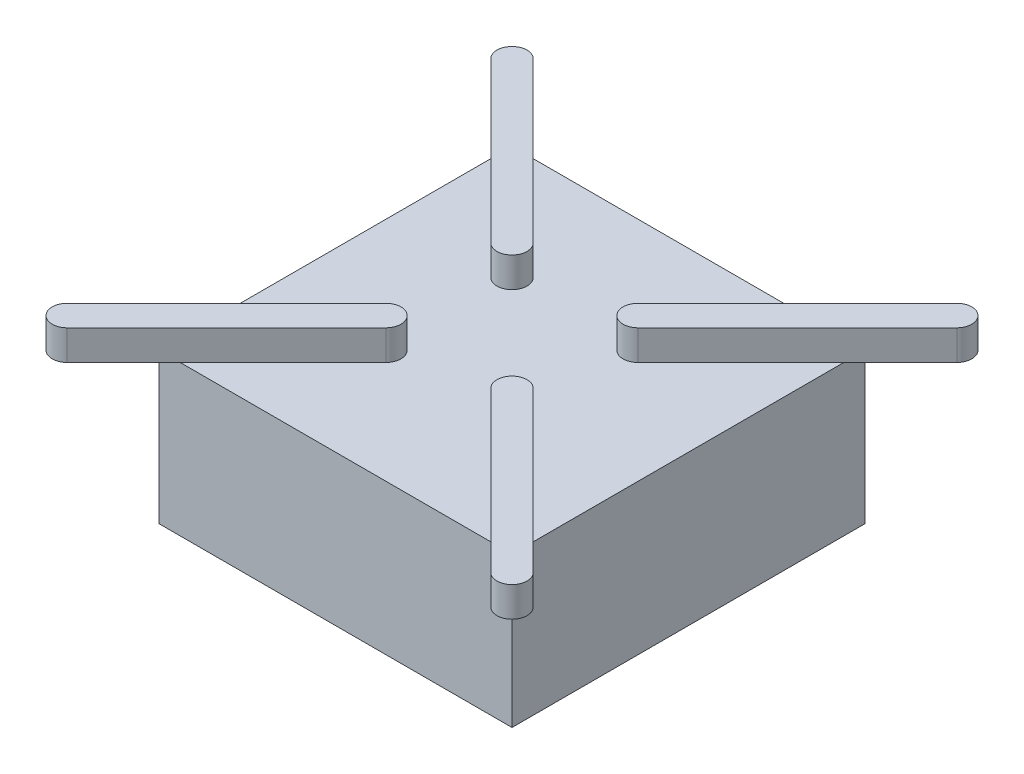
ISO-10303-21;
HEADER;
FILE_DESCRIPTION(('STEP AP214'),'2;1');
FILE_NAME('part.step','',(''),(''),'','','');
FILE_SCHEMA(('AUTOMOTIVE_DESIGN { 1 0 10303 214 1 1 1 1 }'));
ENDSEC;
DATA;
#1=APPLICATION_CONTEXT('core data for automotive mechanical design processes');
#2=APPLICATION_PROTOCOL_DEFINITION('international standard','automotive_design',2000,#1);
#3=PRODUCT_CONTEXT('',#1,'mechanical');
#4=PRODUCT('Part','Part','',(#3));
#5=PRODUCT_RELATED_PRODUCT_CATEGORY('part','',(#4));
#6=PRODUCT_DEFINITION_FORMATION('','',#4);
#7=PRODUCT_DEFINITION_CONTEXT('part definition',#1,'design');
#8=PRODUCT_DEFINITION('design','',#6,#7);
#9=PRODUCT_DEFINITION_SHAPE('','',#8);
#10=(LENGTH_UNIT() NAMED_UNIT(*) SI_UNIT(.MILLI.,.METRE.));
#11=(NAMED_UNIT(*) PLANE_ANGLE_UNIT() SI_UNIT($,.RADIAN.));
#12=(NAMED_UNIT(*) SI_UNIT($,.STERADIAN.) SOLID_ANGLE_UNIT());
#13=UNCERTAINTY_MEASURE_WITH_UNIT(LENGTH_MEASURE(1.E-05),#10,'distance_accuracy_value','');
#14=(GEOMETRIC_REPRESENTATION_CONTEXT(3) GLOBAL_UNCERTAINTY_ASSIGNED_CONTEXT((#13)) GLOBAL_UNIT_ASSIGNED_CONTEXT((#10,
#11,#12)) REPRESENTATION_CONTEXT('',''));
#15=CARTESIAN_POINT('',(0.,0.,0.));
#16=DIRECTION('',(0.,0.,1.));
#17=DIRECTION('',(1.,0.,0.));
#18=AXIS2_PLACEMENT_3D('',#15,#16,#17);
#19=CARTESIAN_POINT('',(0.,0.,0.));
#20=DIRECTION('',(0.,1.,0.));
#21=DIRECTION('',(0.,0.,1.));
#22=AXIS2_PLACEMENT_3D('',#19,#20,#21);
#23=PLANE('',#22);
#24=DIRECTION('',(0.,0.,1.));
#25=VECTOR('',#24,1.);
#26=CARTESIAN_POINT('',(-23.5,0.,-23.5));
#27=LINE('',#26,#25);
#28=CARTESIAN_POINT('',(-23.5,0.,-23.5));
#29=VERTEX_POINT('',#28);
#30=CARTESIAN_POINT('',(-23.5,0.,23.5));
#31=VERTEX_POINT('',#30);
#32=EDGE_CURVE('E402',#29,#31,#27,.T.);
#33=ORIENTED_EDGE('',*,*,#32,.F.);
#34=DIRECTION('',(-1.,0.,0.));
#35=VECTOR('',#34,1.);
#36=CARTESIAN_POINT('',(-23.5,0.,-23.5));
#37=LINE('',#36,#35);
#38=CARTESIAN_POINT('',(23.5,0.,-23.5));
#39=VERTEX_POINT('',#38);
#40=EDGE_CURVE('E429',#39,#29,#37,.T.);
#41=ORIENTED_EDGE('',*,*,#40,.F.);
#42=DIRECTION('',(0.,0.,-1.));
#43=VECTOR('',#42,1.);
#44=CARTESIAN_POINT('',(23.5,0.,-23.5));
#45=LINE('',#44,#43);
#46=CARTESIAN_POINT('',(23.5,0.,23.5));
#47=VERTEX_POINT('',#46);
#48=EDGE_CURVE('E427',#47,#39,#45,.T.);
#49=ORIENTED_EDGE('',*,*,#48,.F.);
#50=DIRECTION('',(1.,0.,0.));
#51=VECTOR('',#50,1.);
#52=CARTESIAN_POINT('',(-23.5,0.,23.5));
#53=LINE('',#52,#51);
#54=EDGE_CURVE('E425',#31,#47,#53,.T.);
#55=ORIENTED_EDGE('',*,*,#54,.F.);
#56=EDGE_LOOP('',(#33,#41,#49,#55));
#57=FACE_BOUND('',#56,.T.);
#58=CARTESIAN_POINT('',(19.,0.,-19.));
#59=DIRECTION('',(0.,1.,0.));
#60=DIRECTION('',(0.,0.,1.));
#61=AXIS2_PLACEMENT_3D('',#58,#59,#60);
#62=CIRCLE('',#61,1.);
#63=CARTESIAN_POINT('',(19.,0.,-18.));
#64=VERTEX_POINT('',#63);
#65=EDGE_CURVE('E442',#64,#64,#62,.F.);
#66=ORIENTED_EDGE('',*,*,#65,.F.);
#67=EDGE_LOOP('',(#66));
#68=FACE_BOUND('',#67,.T.);
#69=CARTESIAN_POINT('',(-19.,0.,-19.));
#70=DIRECTION('',(0.,1.,0.));
#71=DIRECTION('',(0.,0.,1.));
#72=AXIS2_PLACEMENT_3D('',#69,#70,#71);
#73=CIRCLE('',#72,1.);
#74=CARTESIAN_POINT('',(-19.,0.,-18.));
#75=VERTEX_POINT('',#74);
#76=EDGE_CURVE('E445',#75,#75,#73,.F.);
#77=ORIENTED_EDGE('',*,*,#76,.F.);
#78=EDGE_LOOP('',(#77));
#79=FACE_BOUND('',#78,.T.);
#80=CARTESIAN_POINT('',(-19.,0.,19.));
#81=DIRECTION('',(0.,1.,0.));
#82=DIRECTION('',(0.,0.,1.));
#83=AXIS2_PLACEMENT_3D('',#80,#81,#82);
#84=CIRCLE('',#83,1.);
#85=CARTESIAN_POINT('',(-19.,0.,20.));
#86=VERTEX_POINT('',#85);
#87=EDGE_CURVE('E448',#86,#86,#84,.F.);
#88=ORIENTED_EDGE('',*,*,#87,.F.);
#89=EDGE_LOOP('',(#88));
#90=FACE_BOUND('',#89,.T.);
#91=CARTESIAN_POINT('',(19.,0.,19.));
#92=DIRECTION('',(0.,1.,0.));
#93=DIRECTION('',(0.,0.,1.));
#94=AXIS2_PLACEMENT_3D('',#91,#92,#93);
#95=CIRCLE('',#94,1.);
#96=CARTESIAN_POINT('',(19.,0.,20.));
#97=VERTEX_POINT('',#96);
#98=EDGE_CURVE('E450',#97,#97,#95,.F.);
#99=ORIENTED_EDGE('',*,*,#98,.F.);
#100=EDGE_LOOP('',(#99));
#101=FACE_BOUND('',#100,.T.);
#102=DIRECTION('',(0.,0.,-1.));
#103=VECTOR('',#102,1.);
#104=CARTESIAN_POINT('',(-13.,0.,13.));
#105=LINE('',#104,#103);
#106=CARTESIAN_POINT('',(-13.,0.,13.));
#107=VERTEX_POINT('',#106);
#108=CARTESIAN_POINT('',(-13.,0.,-13.));
#109=VERTEX_POINT('',#108);
#110=EDGE_CURVE('E249',#107,#109,#105,.T.);
#111=ORIENTED_EDGE('',*,*,#110,.F.);
#112=DIRECTION('',(-1.,0.,0.));
#113=VECTOR('',#112,1.);
#114=CARTESIAN_POINT('',(-13.,0.,13.));
#115=LINE('',#114,#113);
#116=CARTESIAN_POINT('',(13.,0.,13.));
#117=VERTEX_POINT('',#116);
#118=EDGE_CURVE('E246',#117,#107,#115,.T.);
#119=ORIENTED_EDGE('',*,*,#118,.F.);
#120=DIRECTION('',(0.,0.,1.));
#121=VECTOR('',#120,1.);
#122=CARTESIAN_POINT('',(13.,0.,13.));
#123=LINE('',#122,#121);
#124=CARTESIAN_POINT('',(13.,0.,-13.));
#125=VERTEX_POINT('',#124);
#126=EDGE_CURVE('E64',#125,#117,#123,.T.);
#127=ORIENTED_EDGE('',*,*,#126,.F.);
#128=DIRECTION('',(1.,0.,0.));
#129=VECTOR('',#128,1.);
#130=CARTESIAN_POINT('',(-13.,0.,-13.));
#131=LINE('',#130,#129);
#132=EDGE_CURVE('E59',#109,#125,#131,.T.);
#133=ORIENTED_EDGE('',*,*,#132,.F.);
#134=EDGE_LOOP('',(#111,#119,#127,#133));
#135=FACE_BOUND('',#134,.T.);
#136=ADVANCED_FACE('F44',(#57,#68,#79,#90,#101,#135),#23,.F.);
#137=CARTESIAN_POINT('',(0.,20.,0.));
#138=DIRECTION('',(0.,1.,0.));
#139=DIRECTION('',(0.,0.,1.));
#140=AXIS2_PLACEMENT_3D('',#137,#138,#139);
#141=PLANE('',#140);
#142=DIRECTION('',(-1.,0.,0.));
#143=VECTOR('',#142,1.);
#144=CARTESIAN_POINT('',(-23.5,20.,-23.5));
#145=LINE('',#144,#143);
#146=CARTESIAN_POINT('',(20.6715728752538,20.,-23.5));
#147=VERTEX_POINT('',#146);
#148=CARTESIAN_POINT('',(-20.6715728752538,20.,-23.5));
#149=VERTEX_POINT('',#148);
#150=EDGE_CURVE('E422',#147,#149,#145,.T.);
#151=ORIENTED_EDGE('',*,*,#150,.T.);
#152=DIRECTION('',(-0.707106781186547,0.,-0.707106781186548));
#153=VECTOR('',#152,1.);
#154=CARTESIAN_POINT('',(-6.97918471982869,20.,-9.80761184457488));
#155=LINE('',#154,#153);
#156=CARTESIAN_POINT('',(-6.97918471982869,20.,-9.80761184457488));
#157=VERTEX_POINT('',#156);
#158=EDGE_CURVE('E270',#157,#149,#155,.T.);
#159=ORIENTED_EDGE('',*,*,#158,.F.);
#160=CARTESIAN_POINT('',(-8.39339828220178,20.,-8.39339828220179));
#161=DIRECTION('',(0.,1.,0.));
#162=DIRECTION('',(0.,0.,1.));
#163=AXIS2_PLACEMENT_3D('',#160,#161,#162);
#164=CIRCLE('',#163,2.);
#165=CARTESIAN_POINT('',(-9.80761184457487,20.,-6.97918471982869));
#166=VERTEX_POINT('',#165);
#167=EDGE_CURVE('E250',#166,#157,#164,.T.);
#168=ORIENTED_EDGE('',*,*,#167,.F.);
#169=DIRECTION('',(0.707106781186547,0.,0.707106781186547));
#170=VECTOR('',#169,1.);
#171=CARTESIAN_POINT('',(-9.80761184457487,20.,-6.97918471982869));
#172=LINE('',#171,#170);
#173=CARTESIAN_POINT('',(-23.5,20.,-20.6715728752538));
#174=VERTEX_POINT('',#173);
#175=EDGE_CURVE('E275',#174,#166,#172,.T.);
#176=ORIENTED_EDGE('',*,*,#175,.F.);
#177=DIRECTION('',(0.,0.,1.));
#178=VECTOR('',#177,1.);
#179=CARTESIAN_POINT('',(-23.5,20.,-23.5));
#180=LINE('',#179,#178);
#181=CARTESIAN_POINT('',(-23.5,20.,20.6715728752538));
#182=VERTEX_POINT('',#181);
#183=EDGE_CURVE('E407',#174,#182,#180,.T.);
#184=ORIENTED_EDGE('',*,*,#183,.T.);
#185=DIRECTION('',(-0.707106781186548,0.,0.707106781186547));
#186=VECTOR('',#185,1.);
#187=CARTESIAN_POINT('',(-9.80761184457488,20.,6.97918471982869));
#188=LINE('',#187,#186);
#189=CARTESIAN_POINT('',(-9.80761184457488,20.,6.97918471982869));
#190=VERTEX_POINT('',#189);
#191=EDGE_CURVE('E304',#190,#182,#188,.T.);
#192=ORIENTED_EDGE('',*,*,#191,.F.);
#193=CARTESIAN_POINT('',(-8.39339828220179,20.,8.39339828220179));
#194=DIRECTION('',(0.,1.,0.));
#195=DIRECTION('',(0.,0.,-1.));
#196=AXIS2_PLACEMENT_3D('',#193,#194,#195);
#197=CIRCLE('',#196,2.);
#198=CARTESIAN_POINT('',(-6.97918471982869,20.,9.80761184457488));
#199=VERTEX_POINT('',#198);
#200=EDGE_CURVE('E289',#199,#190,#197,.T.);
#201=ORIENTED_EDGE('',*,*,#200,.F.);
#202=DIRECTION('',(0.707106781186548,0.,-0.707106781186547));
#203=VECTOR('',#202,1.);
#204=CARTESIAN_POINT('',(-6.97918471982869,20.,9.80761184457488));
#205=LINE('',#204,#203);
#206=CARTESIAN_POINT('',(-20.6715728752538,20.,23.5));
#207=VERTEX_POINT('',#206);
#208=EDGE_CURVE('E309',#207,#199,#205,.T.);
#209=ORIENTED_EDGE('',*,*,#208,.F.);
#210=DIRECTION('',(1.,0.,0.));
#211=VECTOR('',#210,1.);
#212=CARTESIAN_POINT('',(-23.5,20.,23.5));
#213=LINE('',#212,#211);
#214=CARTESIAN_POINT('',(20.6715728752538,20.,23.5));
#215=VERTEX_POINT('',#214);
#216=EDGE_CURVE('E412',#207,#215,#213,.T.);
#217=ORIENTED_EDGE('',*,*,#216,.T.);
#218=DIRECTION('',(0.707106781186548,0.,0.707106781186547));
#219=VECTOR('',#218,1.);
#220=CARTESIAN_POINT('',(6.97918471982869,20.,9.80761184457488));
#221=LINE('',#220,#219);
#222=CARTESIAN_POINT('',(6.97918471982869,20.,9.80761184457488));
#223=VERTEX_POINT('',#222);
#224=EDGE_CURVE('E372',#223,#215,#221,.T.);
#225=ORIENTED_EDGE('',*,*,#224,.F.);
#226=CARTESIAN_POINT('',(8.39339828220179,20.,8.39339828220179));
#227=DIRECTION('',(0.,1.,0.));
#228=DIRECTION('',(0.,0.,1.));
#229=AXIS2_PLACEMENT_3D('',#226,#227,#228);
#230=CIRCLE('',#229,2.);
#231=CARTESIAN_POINT('',(9.80761184457488,20.,6.97918471982869));
#232=VERTEX_POINT('',#231);
#233=EDGE_CURVE('E357',#232,#223,#230,.T.);
#234=ORIENTED_EDGE('',*,*,#233,.F.);
#235=DIRECTION('',(-0.707106781186548,0.,-0.707106781186547));
#236=VECTOR('',#235,1.);
#237=CARTESIAN_POINT('',(9.80761184457488,20.,6.97918471982869));
#238=LINE('',#237,#236);
#239=CARTESIAN_POINT('',(23.5,20.,20.6715728752538));
#240=VERTEX_POINT('',#239);
#241=EDGE_CURVE('E52',#240,#232,#238,.T.);
#242=ORIENTED_EDGE('',*,*,#241,.F.);
#243=DIRECTION('',(0.,0.,-1.));
#244=VECTOR('',#243,1.);
#245=CARTESIAN_POINT('',(23.5,20.,-23.5));
#246=LINE('',#245,#244);
#247=CARTESIAN_POINT('',(23.5,20.,-20.6715728752538));
#248=VERTEX_POINT('',#247);
#249=EDGE_CURVE('E417',#240,#248,#246,.T.);
#250=ORIENTED_EDGE('',*,*,#249,.T.);
#251=DIRECTION('',(0.707106781186547,0.,-0.707106781186547));
#252=VECTOR('',#251,1.);
#253=CARTESIAN_POINT('',(9.80761184457487,20.,-6.97918471982869));
#254=LINE('',#253,#252);
#255=CARTESIAN_POINT('',(9.80761184457487,20.,-6.97918471982869));
#256=VERTEX_POINT('',#255);
#257=EDGE_CURVE('E341',#256,#248,#254,.T.);
#258=ORIENTED_EDGE('',*,*,#257,.F.);
#259=CARTESIAN_POINT('',(8.39339828220178,20.,-8.39339828220179));
#260=DIRECTION('',(0.,1.,0.));
#261=DIRECTION('',(0.,0.,-1.));
#262=AXIS2_PLACEMENT_3D('',#259,#260,#261);
#263=CIRCLE('',#262,2.);
#264=CARTESIAN_POINT('',(6.97918471982869,20.,-9.80761184457488));
#265=VERTEX_POINT('',#264);
#266=EDGE_CURVE('E326',#265,#256,#263,.T.);
#267=ORIENTED_EDGE('',*,*,#266,.F.);
#268=DIRECTION('',(0.707106781186547,0.,-0.707106781186548));
#269=VECTOR('',#268,1.);
#270=CARTESIAN_POINT('',(-1.4142135623731,20.,-1.4142135623731));
#271=LINE('',#270,#269);
#272=EDGE_CURVE('E13',#265,#147,#271,.T.);
#273=ORIENTED_EDGE('',*,*,#272,.T.);
#274=EDGE_LOOP('',(#151,#159,#168,#176,#184,#192,#201,#209,#217,#225,#234,#242,#250,#258,#267,#273));
#275=FACE_BOUND('',#274,.T.);
#276=ADVANCED_FACE('F507',(#275),#141,.T.);
#277=CARTESIAN_POINT('',(-23.5,20.,-23.5));
#278=DIRECTION('',(1.,0.,0.));
#279=DIRECTION('',(0.,0.,-1.));
#280=AXIS2_PLACEMENT_3D('',#277,#278,#279);
#281=PLANE('',#280);
#282=ORIENTED_EDGE('',*,*,#32,.T.);
#283=DIRECTION('',(0.,-1.,0.));
#284=VECTOR('',#283,1.);
#285=CARTESIAN_POINT('',(-23.5,20.,23.5));
#286=LINE('',#285,#284);
#287=CARTESIAN_POINT('',(-23.5,20.,23.5));
#288=VERTEX_POINT('',#287);
#289=EDGE_CURVE('E439',#288,#31,#286,.T.);
#290=ORIENTED_EDGE('',*,*,#289,.F.);
#291=DIRECTION('',(0.,0.,-1.));
#292=VECTOR('',#291,1.);
#293=CARTESIAN_POINT('',(-23.5,20.,-23.5));
#294=LINE('',#293,#292);
#295=EDGE_CURVE('E323',#288,#182,#294,.T.);
#296=ORIENTED_EDGE('',*,*,#295,.T.);
#297=ORIENTED_EDGE('',*,*,#183,.F.);
#298=CARTESIAN_POINT('',(-23.5,20.,-23.5));
#299=VERTEX_POINT('',#298);
#300=EDGE_CURVE('E403',#299,#174,#180,.T.);
#301=ORIENTED_EDGE('',*,*,#300,.F.);
#302=DIRECTION('',(0.,-1.,0.));
#303=VECTOR('',#302,1.);
#304=CARTESIAN_POINT('',(-23.5,20.,-23.5));
#305=LINE('',#304,#303);
#306=EDGE_CURVE('E421',#299,#29,#305,.T.);
#307=ORIENTED_EDGE('',*,*,#306,.T.);
#308=EDGE_LOOP('',(#282,#290,#296,#297,#301,#307));
#309=FACE_BOUND('',#308,.T.);
#310=ADVANCED_FACE('F46',(#309),#281,.F.);
#311=CARTESIAN_POINT('',(-23.5,20.,23.5));
#312=DIRECTION('',(0.,0.,-1.));
#313=DIRECTION('',(-1.,0.,0.));
#314=AXIS2_PLACEMENT_3D('',#311,#312,#313);
#315=PLANE('',#314);
#316=ORIENTED_EDGE('',*,*,#54,.T.);
#317=DIRECTION('',(0.,-1.,0.));
#318=VECTOR('',#317,1.);
#319=CARTESIAN_POINT('',(23.5,20.,23.5));
#320=LINE('',#319,#318);
#321=CARTESIAN_POINT('',(23.5,20.,23.5));
#322=VERTEX_POINT('',#321);
#323=EDGE_CURVE('E436',#322,#47,#320,.T.);
#324=ORIENTED_EDGE('',*,*,#323,.F.);
#325=EDGE_CURVE('E406',#215,#322,#213,.T.);
#326=ORIENTED_EDGE('',*,*,#325,.F.);
#327=ORIENTED_EDGE('',*,*,#216,.F.);
#328=EDGE_CURVE('E408',#288,#207,#213,.T.);
#329=ORIENTED_EDGE('',*,*,#328,.F.);
#330=ORIENTED_EDGE('',*,*,#289,.T.);
#331=EDGE_LOOP('',(#316,#324,#326,#327,#329,#330));
#332=FACE_BOUND('',#331,.T.);
#333=ADVANCED_FACE('F546',(#332),#315,.F.);
#334=CARTESIAN_POINT('',(23.5,20.,-23.5));
#335=DIRECTION('',(-1.,0.,0.));
#336=DIRECTION('',(0.,0.,1.));
#337=AXIS2_PLACEMENT_3D('',#334,#335,#336);
#338=PLANE('',#337);
#339=ORIENTED_EDGE('',*,*,#48,.T.);
#340=DIRECTION('',(0.,-1.,0.));
#341=VECTOR('',#340,1.);
#342=CARTESIAN_POINT('',(23.5,20.,-23.5));
#343=LINE('',#342,#341);
#344=CARTESIAN_POINT('',(23.5,20.,-23.5));
#345=VERTEX_POINT('',#344);
#346=EDGE_CURVE('E433',#345,#39,#343,.T.);
#347=ORIENTED_EDGE('',*,*,#346,.F.);
#348=EDGE_CURVE('E411',#248,#345,#246,.T.);
#349=ORIENTED_EDGE('',*,*,#348,.F.);
#350=ORIENTED_EDGE('',*,*,#249,.F.);
#351=EDGE_CURVE('E413',#322,#240,#246,.T.);
#352=ORIENTED_EDGE('',*,*,#351,.F.);
#353=ORIENTED_EDGE('',*,*,#323,.T.);
#354=EDGE_LOOP('',(#339,#347,#349,#350,#352,#353));
#355=FACE_BOUND('',#354,.T.);
#356=ADVANCED_FACE('F481',(#355),#338,.F.);
#357=CARTESIAN_POINT('',(-23.5,20.,-23.5));
#358=DIRECTION('',(0.,0.,1.));
#359=DIRECTION('',(1.,0.,0.));
#360=AXIS2_PLACEMENT_3D('',#357,#358,#359);
#361=PLANE('',#360);
#362=ORIENTED_EDGE('',*,*,#40,.T.);
#363=ORIENTED_EDGE('',*,*,#306,.F.);
#364=EDGE_CURVE('E416',#149,#299,#145,.T.);
#365=ORIENTED_EDGE('',*,*,#364,.F.);
#366=ORIENTED_EDGE('',*,*,#150,.F.);
#367=EDGE_CURVE('E418',#345,#147,#145,.T.);
#368=ORIENTED_EDGE('',*,*,#367,.F.);
#369=ORIENTED_EDGE('',*,*,#346,.T.);
#370=EDGE_LOOP('',(#362,#363,#365,#366,#368,#369));
#371=FACE_BOUND('',#370,.T.);
#372=ADVANCED_FACE('F494',(#371),#361,.F.);
#373=CARTESIAN_POINT('',(19.,-3.,-19.));
#374=DIRECTION('',(0.,1.,0.));
#375=DIRECTION('',(0.,0.,1.));
#376=AXIS2_PLACEMENT_3D('',#373,#374,#375);
#377=CYLINDRICAL_SURFACE('',#376,1.);
#378=CARTESIAN_POINT('',(19.,-3.,-19.));
#379=DIRECTION('',(0.,-1.,0.));
#380=DIRECTION('',(0.,0.,-1.));
#381=AXIS2_PLACEMENT_3D('',#378,#379,#380);
#382=CIRCLE('',#381,1.);
#383=CARTESIAN_POINT('',(19.,-3.,-20.));
#384=VERTEX_POINT('',#383);
#385=EDGE_CURVE('E399',#384,#384,#382,.T.);
#386=ORIENTED_EDGE('',*,*,#385,.F.);
#387=EDGE_LOOP('',(#386));
#388=FACE_BOUND('',#387,.T.);
#389=ORIENTED_EDGE('',*,*,#65,.T.);
#390=EDGE_LOOP('',(#389));
#391=FACE_BOUND('',#390,.T.);
#392=ADVANCED_FACE('F544',(#388,#391),#377,.T.);
#393=CARTESIAN_POINT('',(19.,-3.,-19.));
#394=DIRECTION('',(0.,-1.,0.));
#395=DIRECTION('',(0.,0.,-1.));
#396=AXIS2_PLACEMENT_3D('',#393,#394,#395);
#397=PLANE('',#396);
#398=ORIENTED_EDGE('',*,*,#385,.T.);
#399=EDGE_LOOP('',(#398));
#400=FACE_BOUND('',#399,.T.);
#401=ADVANCED_FACE('F611',(#400),#397,.T.);
#402=CARTESIAN_POINT('',(-19.,-3.,-19.));
#403=DIRECTION('',(0.,1.,0.));
#404=DIRECTION('',(0.,0.,1.));
#405=AXIS2_PLACEMENT_3D('',#402,#403,#404);
#406=CYLINDRICAL_SURFACE('',#405,1.);
#407=CARTESIAN_POINT('',(-19.,-3.,-19.));
#408=DIRECTION('',(0.,-1.,0.));
#409=DIRECTION('',(0.,0.,1.));
#410=AXIS2_PLACEMENT_3D('',#407,#408,#409);
#411=CIRCLE('',#410,1.);
#412=CARTESIAN_POINT('',(-19.,-3.,-18.));
#413=VERTEX_POINT('',#412);
#414=EDGE_CURVE('E396',#413,#413,#411,.T.);
#415=ORIENTED_EDGE('',*,*,#414,.F.);
#416=EDGE_LOOP('',(#415));
#417=FACE_BOUND('',#416,.T.);
#418=ORIENTED_EDGE('',*,*,#76,.T.);
#419=EDGE_LOOP('',(#418));
#420=FACE_BOUND('',#419,.T.);
#421=ADVANCED_FACE('F607',(#417,#420),#406,.T.);
#422=CARTESIAN_POINT('',(-19.,-3.,-19.));
#423=DIRECTION('',(0.,1.,0.));
#424=DIRECTION('',(0.,0.,1.));
#425=AXIS2_PLACEMENT_3D('',#422,#423,#424);
#426=PLANE('',#425);
#427=ORIENTED_EDGE('',*,*,#414,.T.);
#428=EDGE_LOOP('',(#427));
#429=FACE_BOUND('',#428,.T.);
#430=ADVANCED_FACE('F603',(#429),#426,.F.);
#431=CARTESIAN_POINT('',(-19.,-3.,19.));
#432=DIRECTION('',(0.,1.,0.));
#433=DIRECTION('',(0.,0.,1.));
#434=AXIS2_PLACEMENT_3D('',#431,#432,#433);
#435=CYLINDRICAL_SURFACE('',#434,1.);
#436=CARTESIAN_POINT('',(-19.,-3.,19.));
#437=DIRECTION('',(0.,-1.,0.));
#438=DIRECTION('',(0.,0.,-1.));
#439=AXIS2_PLACEMENT_3D('',#436,#437,#438);
#440=CIRCLE('',#439,1.);
#441=CARTESIAN_POINT('',(-19.,-3.,18.));
#442=VERTEX_POINT('',#441);
#443=EDGE_CURVE('E393',#442,#442,#440,.T.);
#444=ORIENTED_EDGE('',*,*,#443,.F.);
#445=EDGE_LOOP('',(#444));
#446=FACE_BOUND('',#445,.T.);
#447=ORIENTED_EDGE('',*,*,#87,.T.);
#448=EDGE_LOOP('',(#447));
#449=FACE_BOUND('',#448,.T.);
#450=ADVANCED_FACE('F599',(#446,#449),#435,.T.);
#451=CARTESIAN_POINT('',(-19.,-3.,19.));
#452=DIRECTION('',(0.,-1.,0.));
#453=DIRECTION('',(0.,0.,-1.));
#454=AXIS2_PLACEMENT_3D('',#451,#452,#453);
#455=PLANE('',#454);
#456=ORIENTED_EDGE('',*,*,#443,.T.);
#457=EDGE_LOOP('',(#456));
#458=FACE_BOUND('',#457,.T.);
#459=ADVANCED_FACE('F595',(#458),#455,.T.);
#460=CARTESIAN_POINT('',(19.,-3.,19.));
#461=DIRECTION('',(0.,1.,0.));
#462=DIRECTION('',(0.,0.,1.));
#463=AXIS2_PLACEMENT_3D('',#460,#461,#462);
#464=CYLINDRICAL_SURFACE('',#463,1.);
#465=CARTESIAN_POINT('',(19.,-3.,19.));
#466=DIRECTION('',(0.,-1.,0.));
#467=DIRECTION('',(0.,0.,1.));
#468=AXIS2_PLACEMENT_3D('',#465,#466,#467);
#469=CIRCLE('',#468,1.);
#470=CARTESIAN_POINT('',(19.,-3.,20.));
#471=VERTEX_POINT('',#470);
#472=EDGE_CURVE('E390',#471,#471,#469,.T.);
#473=ORIENTED_EDGE('',*,*,#472,.F.);
#474=EDGE_LOOP('',(#473));
#475=FACE_BOUND('',#474,.T.);
#476=ORIENTED_EDGE('',*,*,#98,.T.);
#477=EDGE_LOOP('',(#476));
#478=FACE_BOUND('',#477,.T.);
#479=ADVANCED_FACE('F591',(#475,#478),#464,.T.);
#480=CARTESIAN_POINT('',(19.,-3.,19.));
#481=DIRECTION('',(0.,1.,0.));
#482=DIRECTION('',(0.,0.,1.));
#483=AXIS2_PLACEMENT_3D('',#480,#481,#482);
#484=PLANE('',#483);
#485=ORIENTED_EDGE('',*,*,#472,.T.);
#486=EDGE_LOOP('',(#485));
#487=FACE_BOUND('',#486,.T.);
#488=ADVANCED_FACE('F588',(#487),#484,.F.);
#489=CARTESIAN_POINT('',(8.39339828220179,20.,8.39339828220179));
#490=DIRECTION('',(0.,1.,0.));
#491=DIRECTION('',(0.,0.,1.));
#492=AXIS2_PLACEMENT_3D('',#489,#490,#491);
#493=PLANE('',#492);
#494=CARTESIAN_POINT('',(28.1923881554251,20.,31.0208152801713));
#495=VERTEX_POINT('',#494);
#496=EDGE_CURVE('E371',#215,#495,#221,.T.);
#497=ORIENTED_EDGE('',*,*,#496,.F.);
#498=ORIENTED_EDGE('',*,*,#325,.T.);
#499=ORIENTED_EDGE('',*,*,#351,.T.);
#500=CARTESIAN_POINT('',(31.0208152801713,20.,28.1923881554251));
#501=VERTEX_POINT('',#500);
#502=EDGE_CURVE('E362',#501,#240,#238,.T.);
#503=ORIENTED_EDGE('',*,*,#502,.F.);
#504=CARTESIAN_POINT('',(29.6066017177982,20.,29.6066017177982));
#505=DIRECTION('',(0.,1.,0.));
#506=DIRECTION('',(0.,0.,1.));
#507=AXIS2_PLACEMENT_3D('',#504,#505,#506);
#508=CIRCLE('',#507,2.);
#509=EDGE_CURVE('E375',#495,#501,#508,.T.);
#510=ORIENTED_EDGE('',*,*,#509,.F.);
#511=EDGE_LOOP('',(#497,#498,#499,#503,#510));
#512=FACE_BOUND('',#511,.T.);
#513=ADVANCED_FACE('F476',(#512),#493,.F.);
#514=CARTESIAN_POINT('',(8.39339828220179,24.,8.39339828220179));
#515=DIRECTION('',(0.,-1.,0.));
#516=DIRECTION('',(0.,0.,-1.));
#517=AXIS2_PLACEMENT_3D('',#514,#515,#516);
#518=CYLINDRICAL_SURFACE('',#517,2.);
#519=ORIENTED_EDGE('',*,*,#233,.T.);
#520=DIRECTION('',(0.,-1.,0.));
#521=VECTOR('',#520,1.);
#522=CARTESIAN_POINT('',(6.97918471982869,24.,9.80761184457488));
#523=LINE('',#522,#521);
#524=CARTESIAN_POINT('',(6.97918471982869,24.,9.80761184457488));
#525=VERTEX_POINT('',#524);
#526=EDGE_CURVE('E387',#525,#223,#523,.T.);
#527=ORIENTED_EDGE('',*,*,#526,.F.);
#528=CARTESIAN_POINT('',(8.39339828220179,24.,8.39339828220179));
#529=DIRECTION('',(0.,1.,0.));
#530=DIRECTION('',(0.,0.,1.));
#531=AXIS2_PLACEMENT_3D('',#528,#529,#530);
#532=CIRCLE('',#531,2.);
#533=CARTESIAN_POINT('',(9.80761184457488,24.,6.97918471982869));
#534=VERTEX_POINT('',#533);
#535=EDGE_CURVE('E358',#534,#525,#532,.T.);
#536=ORIENTED_EDGE('',*,*,#535,.F.);
#537=DIRECTION('',(0.,-1.,0.));
#538=VECTOR('',#537,1.);
#539=CARTESIAN_POINT('',(9.80761184457488,24.,6.97918471982869));
#540=LINE('',#539,#538);
#541=EDGE_CURVE('E368',#534,#232,#540,.T.);
#542=ORIENTED_EDGE('',*,*,#541,.T.);
#543=EDGE_LOOP('',(#519,#527,#536,#542));
#544=FACE_BOUND('',#543,.T.);
#545=ADVANCED_FACE('F465',(#544),#518,.T.);
#546=CARTESIAN_POINT('',(6.97918471982869,24.,9.80761184457488));
#547=DIRECTION('',(0.707106781186547,0.,-0.707106781186548));
#548=DIRECTION('',(-0.707106781186548,0.,-0.707106781186547));
#549=AXIS2_PLACEMENT_3D('',#546,#547,#548);
#550=PLANE('',#549);
#551=ORIENTED_EDGE('',*,*,#224,.T.);
#552=ORIENTED_EDGE('',*,*,#496,.T.);
#553=DIRECTION('',(0.,-1.,0.));
#554=VECTOR('',#553,1.);
#555=CARTESIAN_POINT('',(28.1923881554251,24.,31.0208152801713));
#556=LINE('',#555,#554);
#557=CARTESIAN_POINT('',(28.1923881554251,24.,31.0208152801713));
#558=VERTEX_POINT('',#557);
#559=EDGE_CURVE('E384',#558,#495,#556,.T.);
#560=ORIENTED_EDGE('',*,*,#559,.F.);
#561=DIRECTION('',(0.707106781186548,0.,0.707106781186547));
#562=VECTOR('',#561,1.);
#563=CARTESIAN_POINT('',(6.97918471982869,24.,9.80761184457488));
#564=LINE('',#563,#562);
#565=EDGE_CURVE('E361',#525,#558,#564,.T.);
#566=ORIENTED_EDGE('',*,*,#565,.F.);
#567=ORIENTED_EDGE('',*,*,#526,.T.);
#568=EDGE_LOOP('',(#551,#552,#560,#566,#567));
#569=FACE_BOUND('',#568,.T.);
#570=ADVANCED_FACE('F574',(#569),#550,.F.);
#571=CARTESIAN_POINT('',(29.6066017177982,24.,29.6066017177982));
#572=DIRECTION('',(0.,-1.,0.));
#573=DIRECTION('',(0.,0.,-1.));
#574=AXIS2_PLACEMENT_3D('',#571,#572,#573);
#575=CYLINDRICAL_SURFACE('',#574,2.);
#576=ORIENTED_EDGE('',*,*,#509,.T.);
#577=DIRECTION('',(0.,-1.,0.));
#578=VECTOR('',#577,1.);
#579=CARTESIAN_POINT('',(31.0208152801713,24.,28.1923881554251));
#580=LINE('',#579,#578);
#581=CARTESIAN_POINT('',(31.0208152801713,24.,28.1923881554251));
#582=VERTEX_POINT('',#581);
#583=EDGE_CURVE('E381',#582,#501,#580,.T.);
#584=ORIENTED_EDGE('',*,*,#583,.F.);
#585=CARTESIAN_POINT('',(29.6066017177982,24.,29.6066017177982));
#586=DIRECTION('',(0.,1.,0.));
#587=DIRECTION('',(0.,0.,1.));
#588=AXIS2_PLACEMENT_3D('',#585,#586,#587);
#589=CIRCLE('',#588,2.);
#590=EDGE_CURVE('E364',#558,#582,#589,.T.);
#591=ORIENTED_EDGE('',*,*,#590,.F.);
#592=ORIENTED_EDGE('',*,*,#559,.T.);
#593=EDGE_LOOP('',(#576,#584,#591,#592));
#594=FACE_BOUND('',#593,.T.);
#595=ADVANCED_FACE('F575',(#594),#575,.T.);
#596=CARTESIAN_POINT('',(9.80761184457488,24.,6.97918471982869));
#597=DIRECTION('',(-0.707106781186547,0.,0.707106781186548));
#598=DIRECTION('',(0.707106781186548,0.,0.707106781186547));
#599=AXIS2_PLACEMENT_3D('',#596,#597,#598);
#600=PLANE('',#599);
#601=ORIENTED_EDGE('',*,*,#502,.T.);
#602=ORIENTED_EDGE('',*,*,#241,.T.);
#603=ORIENTED_EDGE('',*,*,#541,.F.);
#604=DIRECTION('',(-0.707106781186548,0.,-0.707106781186547));
#605=VECTOR('',#604,1.);
#606=CARTESIAN_POINT('',(9.80761184457488,24.,6.97918471982869));
#607=LINE('',#606,#605);
#608=EDGE_CURVE('E366',#582,#534,#607,.T.);
#609=ORIENTED_EDGE('',*,*,#608,.F.);
#610=ORIENTED_EDGE('',*,*,#583,.T.);
#611=EDGE_LOOP('',(#601,#602,#603,#609,#610));
#612=FACE_BOUND('',#611,.T.);
#613=ADVANCED_FACE('F457',(#612),#600,.F.);
#614=CARTESIAN_POINT('',(8.39339828220179,24.,8.39339828220179));
#615=DIRECTION('',(0.,1.,0.));
#616=DIRECTION('',(0.,0.,1.));
#617=AXIS2_PLACEMENT_3D('',#614,#615,#616);
#618=PLANE('',#617);
#619=ORIENTED_EDGE('',*,*,#535,.T.);
#620=ORIENTED_EDGE('',*,*,#565,.T.);
#621=ORIENTED_EDGE('',*,*,#590,.T.);
#622=ORIENTED_EDGE('',*,*,#608,.T.);
#623=EDGE_LOOP('',(#619,#620,#621,#622));
#624=FACE_BOUND('',#623,.T.);
#625=ADVANCED_FACE('F468',(#624),#618,.T.);
#626=CARTESIAN_POINT('',(8.39339828220178,20.,-8.39339828220179));
#627=DIRECTION('',(0.,-1.,0.));
#628=DIRECTION('',(0.,0.,-1.));
#629=AXIS2_PLACEMENT_3D('',#626,#627,#628);
#630=PLANE('',#629);
#631=ORIENTED_EDGE('',*,*,#348,.T.);
#632=ORIENTED_EDGE('',*,*,#367,.T.);
#633=DIRECTION('',(-0.707106781186547,0.,0.707106781186548));
#634=VECTOR('',#633,1.);
#635=CARTESIAN_POINT('',(6.97918471982869,20.,-9.80761184457488));
#636=LINE('',#635,#634);
#637=CARTESIAN_POINT('',(28.1923881554251,20.,-31.0208152801713));
#638=VERTEX_POINT('',#637);
#639=EDGE_CURVE('E331',#638,#147,#636,.T.);
#640=ORIENTED_EDGE('',*,*,#639,.F.);
#641=CARTESIAN_POINT('',(29.6066017177982,20.,-29.6066017177982));
#642=DIRECTION('',(0.,1.,0.));
#643=DIRECTION('',(0.,0.,-1.));
#644=AXIS2_PLACEMENT_3D('',#641,#642,#643);
#645=CIRCLE('',#644,2.);
#646=CARTESIAN_POINT('',(31.0208152801713,20.,-28.1923881554251));
#647=VERTEX_POINT('',#646);
#648=EDGE_CURVE('E344',#647,#638,#645,.T.);
#649=ORIENTED_EDGE('',*,*,#648,.F.);
#650=EDGE_CURVE('E340',#248,#647,#254,.T.);
#651=ORIENTED_EDGE('',*,*,#650,.F.);
#652=EDGE_LOOP('',(#631,#632,#640,#649,#651));
#653=FACE_BOUND('',#652,.T.);
#654=ADVANCED_FACE('F487',(#653),#630,.T.);
#655=CARTESIAN_POINT('',(8.39339828220178,24.,-8.39339828220179));
#656=DIRECTION('',(0.,-1.,0.));
#657=DIRECTION('',(0.,0.,-1.));
#658=AXIS2_PLACEMENT_3D('',#655,#656,#657);
#659=CYLINDRICAL_SURFACE('',#658,2.);
#660=ORIENTED_EDGE('',*,*,#266,.T.);
#661=DIRECTION('',(0.,-1.,0.));
#662=VECTOR('',#661,1.);
#663=CARTESIAN_POINT('',(9.80761184457487,24.,-6.97918471982869));
#664=LINE('',#663,#662);
#665=CARTESIAN_POINT('',(9.80761184457487,24.,-6.97918471982869));
#666=VERTEX_POINT('',#665);
#667=EDGE_CURVE('E355',#666,#256,#664,.T.);
#668=ORIENTED_EDGE('',*,*,#667,.F.);
#669=CARTESIAN_POINT('',(8.39339828220178,24.,-8.39339828220179));
#670=DIRECTION('',(0.,1.,0.));
#671=DIRECTION('',(0.,0.,-1.));
#672=AXIS2_PLACEMENT_3D('',#669,#670,#671);
#673=CIRCLE('',#672,2.);
#674=CARTESIAN_POINT('',(6.97918471982869,24.,-9.80761184457488));
#675=VERTEX_POINT('',#674);
#676=EDGE_CURVE('E327',#675,#666,#673,.T.);
#677=ORIENTED_EDGE('',*,*,#676,.F.);
#678=DIRECTION('',(0.,-1.,0.));
#679=VECTOR('',#678,1.);
#680=CARTESIAN_POINT('',(6.97918471982869,24.,-9.80761184457488));
#681=LINE('',#680,#679);
#682=EDGE_CURVE('E337',#675,#265,#681,.T.);
#683=ORIENTED_EDGE('',*,*,#682,.T.);
#684=EDGE_LOOP('',(#660,#668,#677,#683));
#685=FACE_BOUND('',#684,.T.);
#686=ADVANCED_FACE('F687',(#685),#659,.T.);
#687=CARTESIAN_POINT('',(9.80761184457487,24.,-6.97918471982869));
#688=DIRECTION('',(-0.707106781186548,0.,-0.707106781186548));
#689=DIRECTION('',(-0.707106781186547,0.,0.707106781186548));
#690=AXIS2_PLACEMENT_3D('',#687,#688,#689);
#691=PLANE('',#690);
#692=ORIENTED_EDGE('',*,*,#257,.T.);
#693=ORIENTED_EDGE('',*,*,#650,.T.);
#694=DIRECTION('',(0.,-1.,0.));
#695=VECTOR('',#694,1.);
#696=CARTESIAN_POINT('',(31.0208152801713,24.,-28.1923881554251));
#697=LINE('',#696,#695);
#698=CARTESIAN_POINT('',(31.0208152801713,24.,-28.1923881554251));
#699=VERTEX_POINT('',#698);
#700=EDGE_CURVE('E352',#699,#647,#697,.T.);
#701=ORIENTED_EDGE('',*,*,#700,.F.);
#702=DIRECTION('',(0.707106781186547,0.,-0.707106781186547));
#703=VECTOR('',#702,1.);
#704=CARTESIAN_POINT('',(9.80761184457487,24.,-6.97918471982869));
#705=LINE('',#704,#703);
#706=EDGE_CURVE('E330',#666,#699,#705,.T.);
#707=ORIENTED_EDGE('',*,*,#706,.F.);
#708=ORIENTED_EDGE('',*,*,#667,.T.);
#709=EDGE_LOOP('',(#692,#693,#701,#707,#708));
#710=FACE_BOUND('',#709,.T.);
#711=ADVANCED_FACE('F694',(#710),#691,.F.);
#712=CARTESIAN_POINT('',(29.6066017177982,24.,-29.6066017177982));
#713=DIRECTION('',(0.,-1.,0.));
#714=DIRECTION('',(0.,0.,-1.));
#715=AXIS2_PLACEMENT_3D('',#712,#713,#714);
#716=CYLINDRICAL_SURFACE('',#715,2.);
#717=ORIENTED_EDGE('',*,*,#648,.T.);
#718=DIRECTION('',(0.,-1.,0.));
#719=VECTOR('',#718,1.);
#720=CARTESIAN_POINT('',(28.1923881554251,24.,-31.0208152801713));
#721=LINE('',#720,#719);
#722=CARTESIAN_POINT('',(28.1923881554251,24.,-31.0208152801713));
#723=VERTEX_POINT('',#722);
#724=EDGE_CURVE('E349',#723,#638,#721,.T.);
#725=ORIENTED_EDGE('',*,*,#724,.F.);
#726=CARTESIAN_POINT('',(29.6066017177982,24.,-29.6066017177982));
#727=DIRECTION('',(0.,1.,0.));
#728=DIRECTION('',(0.,0.,-1.));
#729=AXIS2_PLACEMENT_3D('',#726,#727,#728);
#730=CIRCLE('',#729,2.);
#731=EDGE_CURVE('E333',#699,#723,#730,.T.);
#732=ORIENTED_EDGE('',*,*,#731,.F.);
#733=ORIENTED_EDGE('',*,*,#700,.T.);
#734=EDGE_LOOP('',(#717,#725,#732,#733));
#735=FACE_BOUND('',#734,.T.);
#736=ADVANCED_FACE('F690',(#735),#716,.T.);
#737=CARTESIAN_POINT('',(6.97918471982869,24.,-9.80761184457488));
#738=DIRECTION('',(0.707106781186548,0.,0.707106781186547));
#739=DIRECTION('',(0.707106781186547,0.,-0.707106781186548));
#740=AXIS2_PLACEMENT_3D('',#737,#738,#739);
#741=PLANE('',#740);
#742=ORIENTED_EDGE('',*,*,#639,.T.);
#743=ORIENTED_EDGE('',*,*,#272,.F.);
#744=ORIENTED_EDGE('',*,*,#682,.F.);
#745=DIRECTION('',(-0.707106781186547,0.,0.707106781186548));
#746=VECTOR('',#745,1.);
#747=CARTESIAN_POINT('',(6.97918471982869,24.,-9.80761184457488));
#748=LINE('',#747,#746);
#749=EDGE_CURVE('E335',#723,#675,#748,.T.);
#750=ORIENTED_EDGE('',*,*,#749,.F.);
#751=ORIENTED_EDGE('',*,*,#724,.T.);
#752=EDGE_LOOP('',(#742,#743,#744,#750,#751));
#753=FACE_BOUND('',#752,.T.);
#754=ADVANCED_FACE('F683',(#753),#741,.F.);
#755=CARTESIAN_POINT('',(8.39339828220178,24.,-8.39339828220179));
#756=DIRECTION('',(0.,-1.,0.));
#757=DIRECTION('',(0.,0.,-1.));
#758=AXIS2_PLACEMENT_3D('',#755,#756,#757);
#759=PLANE('',#758);
#760=ORIENTED_EDGE('',*,*,#676,.T.);
#761=ORIENTED_EDGE('',*,*,#706,.T.);
#762=ORIENTED_EDGE('',*,*,#731,.T.);
#763=ORIENTED_EDGE('',*,*,#749,.T.);
#764=EDGE_LOOP('',(#760,#761,#762,#763));
#765=FACE_BOUND('',#764,.T.);
#766=ADVANCED_FACE('F672',(#765),#759,.F.);
#767=CARTESIAN_POINT('',(-8.39339828220179,20.,8.39339828220179));
#768=DIRECTION('',(0.,-1.,0.));
#769=DIRECTION('',(0.,0.,-1.));
#770=AXIS2_PLACEMENT_3D('',#767,#768,#769);
#771=PLANE('',#770);
#772=ORIENTED_EDGE('',*,*,#295,.F.);
#773=ORIENTED_EDGE('',*,*,#328,.T.);
#774=CARTESIAN_POINT('',(-28.1923881554251,20.,31.0208152801713));
#775=VERTEX_POINT('',#774);
#776=EDGE_CURVE('E294',#775,#207,#205,.T.);
#777=ORIENTED_EDGE('',*,*,#776,.F.);
#778=CARTESIAN_POINT('',(-29.6066017177982,20.,29.6066017177982));
#779=DIRECTION('',(0.,1.,0.));
#780=DIRECTION('',(0.,0.,-1.));
#781=AXIS2_PLACEMENT_3D('',#778,#779,#780);
#782=CIRCLE('',#781,2.);
#783=CARTESIAN_POINT('',(-31.0208152801713,20.,28.1923881554251));
#784=VERTEX_POINT('',#783);
#785=EDGE_CURVE('E307',#784,#775,#782,.T.);
#786=ORIENTED_EDGE('',*,*,#785,.F.);
#787=EDGE_CURVE('E303',#182,#784,#188,.T.);
#788=ORIENTED_EDGE('',*,*,#787,.F.);
#789=EDGE_LOOP('',(#772,#773,#777,#786,#788));
#790=FACE_BOUND('',#789,.T.);
#791=ADVANCED_FACE('F571',(#790),#771,.T.);
#792=CARTESIAN_POINT('',(-8.39339828220179,24.,8.39339828220179));
#793=DIRECTION('',(0.,-1.,0.));
#794=DIRECTION('',(0.,0.,-1.));
#795=AXIS2_PLACEMENT_3D('',#792,#793,#794);
#796=CYLINDRICAL_SURFACE('',#795,2.);
#797=ORIENTED_EDGE('',*,*,#200,.T.);
#798=DIRECTION('',(0.,-1.,0.));
#799=VECTOR('',#798,1.);
#800=CARTESIAN_POINT('',(-9.80761184457488,24.,6.97918471982869));
#801=LINE('',#800,#799);
#802=CARTESIAN_POINT('',(-9.80761184457488,24.,6.97918471982869));
#803=VERTEX_POINT('',#802);
#804=EDGE_CURVE('E320',#803,#190,#801,.T.);
#805=ORIENTED_EDGE('',*,*,#804,.F.);
#806=CARTESIAN_POINT('',(-8.39339828220179,24.,8.39339828220179));
#807=DIRECTION('',(0.,1.,0.));
#808=DIRECTION('',(0.,0.,-1.));
#809=AXIS2_PLACEMENT_3D('',#806,#807,#808);
#810=CIRCLE('',#809,2.);
#811=CARTESIAN_POINT('',(-6.97918471982869,24.,9.80761184457488));
#812=VERTEX_POINT('',#811);
#813=EDGE_CURVE('E290',#812,#803,#810,.T.);
#814=ORIENTED_EDGE('',*,*,#813,.F.);
#815=DIRECTION('',(0.,-1.,0.));
#816=VECTOR('',#815,1.);
#817=CARTESIAN_POINT('',(-6.97918471982869,24.,9.80761184457488));
#818=LINE('',#817,#816);
#819=EDGE_CURVE('E300',#812,#199,#818,.T.);
#820=ORIENTED_EDGE('',*,*,#819,.T.);
#821=EDGE_LOOP('',(#797,#805,#814,#820));
#822=FACE_BOUND('',#821,.T.);
#823=ADVANCED_FACE('F564',(#822),#796,.T.);
#824=CARTESIAN_POINT('',(-9.80761184457488,24.,6.97918471982869));
#825=DIRECTION('',(0.707106781186547,0.,0.707106781186548));
#826=DIRECTION('',(0.707106781186548,0.,-0.707106781186547));
#827=AXIS2_PLACEMENT_3D('',#824,#825,#826);
#828=PLANE('',#827);
#829=ORIENTED_EDGE('',*,*,#191,.T.);
#830=ORIENTED_EDGE('',*,*,#787,.T.);
#831=DIRECTION('',(0.,-1.,0.));
#832=VECTOR('',#831,1.);
#833=CARTESIAN_POINT('',(-31.0208152801713,24.,28.1923881554251));
#834=LINE('',#833,#832);
#835=CARTESIAN_POINT('',(-31.0208152801713,24.,28.1923881554251));
#836=VERTEX_POINT('',#835);
#837=EDGE_CURVE('E317',#836,#784,#834,.T.);
#838=ORIENTED_EDGE('',*,*,#837,.F.);
#839=DIRECTION('',(-0.707106781186548,0.,0.707106781186547));
#840=VECTOR('',#839,1.);
#841=CARTESIAN_POINT('',(-9.80761184457488,24.,6.97918471982869));
#842=LINE('',#841,#840);
#843=EDGE_CURVE('E293',#803,#836,#842,.T.);
#844=ORIENTED_EDGE('',*,*,#843,.F.);
#845=ORIENTED_EDGE('',*,*,#804,.T.);
#846=EDGE_LOOP('',(#829,#830,#838,#844,#845));
#847=FACE_BOUND('',#846,.T.);
#848=ADVANCED_FACE('F560',(#847),#828,.F.);
#849=CARTESIAN_POINT('',(-29.6066017177982,24.,29.6066017177982));
#850=DIRECTION('',(0.,-1.,0.));
#851=DIRECTION('',(0.,0.,-1.));
#852=AXIS2_PLACEMENT_3D('',#849,#850,#851);
#853=CYLINDRICAL_SURFACE('',#852,2.);
#854=ORIENTED_EDGE('',*,*,#785,.T.);
#855=DIRECTION('',(0.,-1.,0.));
#856=VECTOR('',#855,1.);
#857=CARTESIAN_POINT('',(-28.1923881554251,24.,31.0208152801713));
#858=LINE('',#857,#856);
#859=CARTESIAN_POINT('',(-28.1923881554251,24.,31.0208152801713));
#860=VERTEX_POINT('',#859);
#861=EDGE_CURVE('E314',#860,#775,#858,.T.);
#862=ORIENTED_EDGE('',*,*,#861,.F.);
#863=CARTESIAN_POINT('',(-29.6066017177982,24.,29.6066017177982));
#864=DIRECTION('',(0.,1.,0.));
#865=DIRECTION('',(0.,0.,-1.));
#866=AXIS2_PLACEMENT_3D('',#863,#864,#865);
#867=CIRCLE('',#866,2.);
#868=EDGE_CURVE('E296',#836,#860,#867,.T.);
#869=ORIENTED_EDGE('',*,*,#868,.F.);
#870=ORIENTED_EDGE('',*,*,#837,.T.);
#871=EDGE_LOOP('',(#854,#862,#869,#870));
#872=FACE_BOUND('',#871,.T.);
#873=ADVANCED_FACE('F668',(#872),#853,.T.);
#874=CARTESIAN_POINT('',(-6.97918471982869,24.,9.80761184457488));
#875=DIRECTION('',(-0.707106781186547,0.,-0.707106781186548));
#876=DIRECTION('',(-0.707106781186548,0.,0.707106781186547));
#877=AXIS2_PLACEMENT_3D('',#874,#875,#876);
#878=PLANE('',#877);
#879=ORIENTED_EDGE('',*,*,#776,.T.);
#880=ORIENTED_EDGE('',*,*,#208,.T.);
#881=ORIENTED_EDGE('',*,*,#819,.F.);
#882=DIRECTION('',(0.707106781186548,0.,-0.707106781186547));
#883=VECTOR('',#882,1.);
#884=CARTESIAN_POINT('',(-6.97918471982869,24.,9.80761184457488));
#885=LINE('',#884,#883);
#886=EDGE_CURVE('E298',#860,#812,#885,.T.);
#887=ORIENTED_EDGE('',*,*,#886,.F.);
#888=ORIENTED_EDGE('',*,*,#861,.T.);
#889=EDGE_LOOP('',(#879,#880,#881,#887,#888));
#890=FACE_BOUND('',#889,.T.);
#891=ADVANCED_FACE('F568',(#890),#878,.F.);
#892=CARTESIAN_POINT('',(-8.39339828220179,24.,8.39339828220179));
#893=DIRECTION('',(0.,-1.,0.));
#894=DIRECTION('',(0.,0.,-1.));
#895=AXIS2_PLACEMENT_3D('',#892,#893,#894);
#896=PLANE('',#895);
#897=ORIENTED_EDGE('',*,*,#813,.T.);
#898=ORIENTED_EDGE('',*,*,#843,.T.);
#899=ORIENTED_EDGE('',*,*,#868,.T.);
#900=ORIENTED_EDGE('',*,*,#886,.T.);
#901=EDGE_LOOP('',(#897,#898,#899,#900));
#902=FACE_BOUND('',#901,.T.);
#903=ADVANCED_FACE('F657',(#902),#896,.F.);
#904=CARTESIAN_POINT('',(-8.39339828220178,20.,-8.39339828220179));
#905=DIRECTION('',(0.,1.,0.));
#906=DIRECTION('',(0.,0.,1.));
#907=AXIS2_PLACEMENT_3D('',#904,#905,#906);
#908=PLANE('',#907);
#909=ORIENTED_EDGE('',*,*,#364,.T.);
#910=ORIENTED_EDGE('',*,*,#300,.T.);
#911=CARTESIAN_POINT('',(-31.0208152801713,20.,-28.1923881554251));
#912=VERTEX_POINT('',#911);
#913=EDGE_CURVE('E263',#912,#174,#172,.T.);
#914=ORIENTED_EDGE('',*,*,#913,.F.);
#915=CARTESIAN_POINT('',(-29.6066017177982,20.,-29.6066017177982));
#916=DIRECTION('',(0.,1.,0.));
#917=DIRECTION('',(0.,0.,1.));
#918=AXIS2_PLACEMENT_3D('',#915,#916,#917);
#919=CIRCLE('',#918,2.);
#920=CARTESIAN_POINT('',(-28.1923881554251,20.,-31.0208152801713));
#921=VERTEX_POINT('',#920);
#922=EDGE_CURVE('E273',#921,#912,#919,.T.);
#923=ORIENTED_EDGE('',*,*,#922,.F.);
#924=EDGE_CURVE('E253',#149,#921,#155,.T.);
#925=ORIENTED_EDGE('',*,*,#924,.F.);
#926=EDGE_LOOP('',(#909,#910,#914,#923,#925));
#927=FACE_BOUND('',#926,.T.);
#928=ADVANCED_FACE('F500',(#927),#908,.F.);
#929=CARTESIAN_POINT('',(-8.39339828220178,24.,-8.39339828220179));
#930=DIRECTION('',(0.,-1.,0.));
#931=DIRECTION('',(0.,0.,-1.));
#932=AXIS2_PLACEMENT_3D('',#929,#930,#931);
#933=CYLINDRICAL_SURFACE('',#932,2.);
#934=ORIENTED_EDGE('',*,*,#167,.T.);
#935=DIRECTION('',(0.,-1.,0.));
#936=VECTOR('',#935,1.);
#937=CARTESIAN_POINT('',(-6.97918471982869,24.,-9.80761184457488));
#938=LINE('',#937,#936);
#939=CARTESIAN_POINT('',(-6.97918471982869,24.,-9.80761184457488));
#940=VERTEX_POINT('',#939);
#941=EDGE_CURVE('E286',#940,#157,#938,.T.);
#942=ORIENTED_EDGE('',*,*,#941,.F.);
#943=CARTESIAN_POINT('',(-8.39339828220178,24.,-8.39339828220179));
#944=DIRECTION('',(0.,1.,0.));
#945=DIRECTION('',(0.,0.,1.));
#946=AXIS2_PLACEMENT_3D('',#943,#944,#945);
#947=CIRCLE('',#946,2.);
#948=CARTESIAN_POINT('',(-9.80761184457487,24.,-6.97918471982869));
#949=VERTEX_POINT('',#948);
#950=EDGE_CURVE('E259',#949,#940,#947,.T.);
#951=ORIENTED_EDGE('',*,*,#950,.F.);
#952=DIRECTION('',(0.,-1.,0.));
#953=VECTOR('',#952,1.);
#954=CARTESIAN_POINT('',(-9.80761184457487,24.,-6.97918471982869));
#955=LINE('',#954,#953);
#956=EDGE_CURVE('E268',#949,#166,#955,.T.);
#957=ORIENTED_EDGE('',*,*,#956,.T.);
#958=EDGE_LOOP('',(#934,#942,#951,#957));
#959=FACE_BOUND('',#958,.T.);
#960=ADVANCED_FACE('F516',(#959),#933,.T.);
#961=CARTESIAN_POINT('',(-6.97918471982869,24.,-9.80761184457488));
#962=DIRECTION('',(-0.707106781186548,0.,0.707106781186547));
#963=DIRECTION('',(0.707106781186547,0.,0.707106781186548));
#964=AXIS2_PLACEMENT_3D('',#961,#962,#963);
#965=PLANE('',#964);
#966=ORIENTED_EDGE('',*,*,#158,.T.);
#967=ORIENTED_EDGE('',*,*,#924,.T.);
#968=DIRECTION('',(0.,-1.,0.));
#969=VECTOR('',#968,1.);
#970=CARTESIAN_POINT('',(-28.1923881554251,24.,-31.0208152801713));
#971=LINE('',#970,#969);
#972=CARTESIAN_POINT('',(-28.1923881554251,24.,-31.0208152801713));
#973=VERTEX_POINT('',#972);
#974=EDGE_CURVE('E283',#973,#921,#971,.T.);
#975=ORIENTED_EDGE('',*,*,#974,.F.);
#976=DIRECTION('',(-0.707106781186547,0.,-0.707106781186548));
#977=VECTOR('',#976,1.);
#978=CARTESIAN_POINT('',(-6.97918471982869,24.,-9.80761184457488));
#979=LINE('',#978,#977);
#980=EDGE_CURVE('E262',#940,#973,#979,.T.);
#981=ORIENTED_EDGE('',*,*,#980,.F.);
#982=ORIENTED_EDGE('',*,*,#941,.T.);
#983=EDGE_LOOP('',(#966,#967,#975,#981,#982));
#984=FACE_BOUND('',#983,.T.);
#985=ADVANCED_FACE('F505',(#984),#965,.F.);
#986=CARTESIAN_POINT('',(-29.6066017177982,24.,-29.6066017177982));
#987=DIRECTION('',(0.,-1.,0.));
#988=DIRECTION('',(0.,0.,-1.));
#989=AXIS2_PLACEMENT_3D('',#986,#987,#988);
#990=CYLINDRICAL_SURFACE('',#989,2.);
#991=ORIENTED_EDGE('',*,*,#922,.T.);
#992=DIRECTION('',(0.,-1.,0.));
#993=VECTOR('',#992,1.);
#994=CARTESIAN_POINT('',(-31.0208152801713,24.,-28.1923881554251));
#995=LINE('',#994,#993);
#996=CARTESIAN_POINT('',(-31.0208152801713,24.,-28.1923881554251));
#997=VERTEX_POINT('',#996);
#998=EDGE_CURVE('E280',#997,#912,#995,.T.);
#999=ORIENTED_EDGE('',*,*,#998,.F.);
#1000=CARTESIAN_POINT('',(-29.6066017177982,24.,-29.6066017177982));
#1001=DIRECTION('',(0.,1.,0.));
#1002=DIRECTION('',(0.,0.,1.));
#1003=AXIS2_PLACEMENT_3D('',#1000,#1001,#1002);
#1004=CIRCLE('',#1003,2.);
#1005=EDGE_CURVE('E265',#973,#997,#1004,.T.);
#1006=ORIENTED_EDGE('',*,*,#1005,.F.);
#1007=ORIENTED_EDGE('',*,*,#974,.T.);
#1008=EDGE_LOOP('',(#991,#999,#1006,#1007));
#1009=FACE_BOUND('',#1008,.T.);
#1010=ADVANCED_FACE('F522',(#1009),#990,.T.);
#1011=CARTESIAN_POINT('',(-9.80761184457487,24.,-6.97918471982869));
#1012=DIRECTION('',(0.707106781186548,0.,-0.707106781186548));
#1013=DIRECTION('',(-0.707106781186547,0.,-0.707106781186548));
#1014=AXIS2_PLACEMENT_3D('',#1011,#1012,#1013);
#1015=PLANE('',#1014);
#1016=ORIENTED_EDGE('',*,*,#913,.T.);
#1017=ORIENTED_EDGE('',*,*,#175,.T.);
#1018=ORIENTED_EDGE('',*,*,#956,.F.);
#1019=DIRECTION('',(0.707106781186547,0.,0.707106781186547));
#1020=VECTOR('',#1019,1.);
#1021=CARTESIAN_POINT('',(-9.80761184457487,24.,-6.97918471982869));
#1022=LINE('',#1021,#1020);
#1023=EDGE_CURVE('E267',#997,#949,#1022,.T.);
#1024=ORIENTED_EDGE('',*,*,#1023,.F.);
#1025=ORIENTED_EDGE('',*,*,#998,.T.);
#1026=EDGE_LOOP('',(#1016,#1017,#1018,#1024,#1025));
#1027=FACE_BOUND('',#1026,.T.);
#1028=ADVANCED_FACE('F513',(#1027),#1015,.F.);
#1029=CARTESIAN_POINT('',(-8.39339828220178,24.,-8.39339828220179));
#1030=DIRECTION('',(0.,1.,0.));
#1031=DIRECTION('',(0.,0.,1.));
#1032=AXIS2_PLACEMENT_3D('',#1029,#1030,#1031);
#1033=PLANE('',#1032);
#1034=ORIENTED_EDGE('',*,*,#950,.T.);
#1035=ORIENTED_EDGE('',*,*,#980,.T.);
#1036=ORIENTED_EDGE('',*,*,#1005,.T.);
#1037=ORIENTED_EDGE('',*,*,#1023,.T.);
#1038=EDGE_LOOP('',(#1034,#1035,#1036,#1037));
#1039=FACE_BOUND('',#1038,.T.);
#1040=ADVANCED_FACE('F518',(#1039),#1033,.T.);
#1041=CARTESIAN_POINT('',(-13.,-2.,13.));
#1042=DIRECTION('',(1.,0.,0.));
#1043=DIRECTION('',(0.,0.,-1.));
#1044=AXIS2_PLACEMENT_3D('',#1041,#1042,#1043);
#1045=PLANE('',#1044);
#1046=ORIENTED_EDGE('',*,*,#110,.T.);
#1047=DIRECTION('',(0.,1.,0.));
#1048=VECTOR('',#1047,1.);
#1049=CARTESIAN_POINT('',(-13.,-2.,-13.));
#1050=LINE('',#1049,#1048);
#1051=CARTESIAN_POINT('',(-13.,-2.,-13.));
#1052=VERTEX_POINT('',#1051);
#1053=EDGE_CURVE('E230',#1052,#109,#1050,.T.);
#1054=ORIENTED_EDGE('',*,*,#1053,.F.);
#1055=DIRECTION('',(0.,0.,-1.));
#1056=VECTOR('',#1055,1.);
#1057=CARTESIAN_POINT('',(-13.,-2.,13.));
#1058=LINE('',#1057,#1056);
#1059=CARTESIAN_POINT('',(-13.,-2.,13.));
#1060=VERTEX_POINT('',#1059);
#1061=EDGE_CURVE('E237',#1060,#1052,#1058,.T.);
#1062=ORIENTED_EDGE('',*,*,#1061,.F.);
#1063=DIRECTION('',(0.,1.,0.));
#1064=VECTOR('',#1063,1.);
#1065=CARTESIAN_POINT('',(-13.,-2.,13.));
#1066=LINE('',#1065,#1064);
#1067=EDGE_CURVE('E632',#1060,#107,#1066,.T.);
#1068=ORIENTED_EDGE('',*,*,#1067,.T.);
#1069=EDGE_LOOP('',(#1046,#1054,#1062,#1068));
#1070=FACE_BOUND('',#1069,.T.);
#1071=ADVANCED_FACE('F248',(#1070),#1045,.F.);
#1072=CARTESIAN_POINT('',(-13.,-2.,-13.));
#1073=DIRECTION('',(0.,0.,1.));
#1074=DIRECTION('',(1.,0.,0.));
#1075=AXIS2_PLACEMENT_3D('',#1072,#1073,#1074);
#1076=PLANE('',#1075);
#1077=ORIENTED_EDGE('',*,*,#132,.T.);
#1078=DIRECTION('',(0.,1.,0.));
#1079=VECTOR('',#1078,1.);
#1080=CARTESIAN_POINT('',(13.,-2.,-13.));
#1081=LINE('',#1080,#1079);
#1082=CARTESIAN_POINT('',(13.,-2.,-13.));
#1083=VERTEX_POINT('',#1082);
#1084=EDGE_CURVE('E233',#1083,#125,#1081,.T.);
#1085=ORIENTED_EDGE('',*,*,#1084,.F.);
#1086=DIRECTION('',(1.,0.,0.));
#1087=VECTOR('',#1086,1.);
#1088=CARTESIAN_POINT('',(-13.,-2.,-13.));
#1089=LINE('',#1088,#1087);
#1090=EDGE_CURVE('E226',#1052,#1083,#1089,.T.);
#1091=ORIENTED_EDGE('',*,*,#1090,.F.);
#1092=ORIENTED_EDGE('',*,*,#1053,.T.);
#1093=EDGE_LOOP('',(#1077,#1085,#1091,#1092));
#1094=FACE_BOUND('',#1093,.T.);
#1095=ADVANCED_FACE('F228',(#1094),#1076,.F.);
#1096=CARTESIAN_POINT('',(13.,-2.,13.));
#1097=DIRECTION('',(-1.,0.,0.));
#1098=DIRECTION('',(0.,0.,1.));
#1099=AXIS2_PLACEMENT_3D('',#1096,#1097,#1098);
#1100=PLANE('',#1099);
#1101=ORIENTED_EDGE('',*,*,#126,.T.);
#1102=DIRECTION('',(0.,1.,0.));
#1103=VECTOR('',#1102,1.);
#1104=CARTESIAN_POINT('',(13.,-2.,13.));
#1105=LINE('',#1104,#1103);
#1106=CARTESIAN_POINT('',(13.,-2.,13.));
#1107=VERTEX_POINT('',#1106);
#1108=EDGE_CURVE('E255',#1107,#117,#1105,.T.);
#1109=ORIENTED_EDGE('',*,*,#1108,.F.);
#1110=DIRECTION('',(0.,0.,1.));
#1111=VECTOR('',#1110,1.);
#1112=CARTESIAN_POINT('',(13.,-2.,13.));
#1113=LINE('',#1112,#1111);
#1114=EDGE_CURVE('E236',#1083,#1107,#1113,.T.);
#1115=ORIENTED_EDGE('',*,*,#1114,.F.);
#1116=ORIENTED_EDGE('',*,*,#1084,.T.);
#1117=EDGE_LOOP('',(#1101,#1109,#1115,#1116));
#1118=FACE_BOUND('',#1117,.T.);
#1119=ADVANCED_FACE('F641',(#1118),#1100,.F.);
#1120=CARTESIAN_POINT('',(-13.,-2.,13.));
#1121=DIRECTION('',(0.,0.,-1.));
#1122=DIRECTION('',(-1.,0.,0.));
#1123=AXIS2_PLACEMENT_3D('',#1120,#1121,#1122);
#1124=PLANE('',#1123);
#1125=ORIENTED_EDGE('',*,*,#118,.T.);
#1126=ORIENTED_EDGE('',*,*,#1067,.F.);
#1127=DIRECTION('',(-1.,0.,0.));
#1128=VECTOR('',#1127,1.);
#1129=CARTESIAN_POINT('',(-13.,-2.,13.));
#1130=LINE('',#1129,#1128);
#1131=EDGE_CURVE('E242',#1107,#1060,#1130,.T.);
#1132=ORIENTED_EDGE('',*,*,#1131,.F.);
#1133=ORIENTED_EDGE('',*,*,#1108,.T.);
#1134=EDGE_LOOP('',(#1125,#1126,#1132,#1133));
#1135=FACE_BOUND('',#1134,.T.);
#1136=ADVANCED_FACE('F631',(#1135),#1124,.F.);
#1137=CARTESIAN_POINT('',(0.,-2.,0.));
#1138=DIRECTION('',(0.,-1.,0.));
#1139=DIRECTION('',(0.,0.,-1.));
#1140=AXIS2_PLACEMENT_3D('',#1137,#1138,#1139);
#1141=PLANE('',#1140);
#1142=ORIENTED_EDGE('',*,*,#1061,.T.);
#1143=ORIENTED_EDGE('',*,*,#1090,.T.);
#1144=ORIENTED_EDGE('',*,*,#1114,.T.);
#1145=ORIENTED_EDGE('',*,*,#1131,.T.);
#1146=EDGE_LOOP('',(#1142,#1143,#1144,#1145));
#1147=FACE_BOUND('',#1146,.T.);
#1148=ADVANCED_FACE('F240',(#1147),#1141,.T.);
#1149=CLOSED_SHELL('',(#136,#276,#310,#333,#356,#372,#392,#401,#421,#430,#450,#459,#479,#488,
#513,#545,#570,#595,#613,#625,#654,#686,#711,#736,#754,#766,#791,#823,#848,#873,#891,#903,#928,
#960,#985,#1010,#1028,#1040,#1071,#1095,#1119,#1136,#1148));
#1150=MANIFOLD_SOLID_BREP('B2',#1149);
#1151=ADVANCED_BREP_SHAPE_REPRESENTATION('',(#18,#1150),#14);
#1152=SHAPE_DEFINITION_REPRESENTATION(#9,#1151);
ENDSEC;
END-ISO-10303-21;
